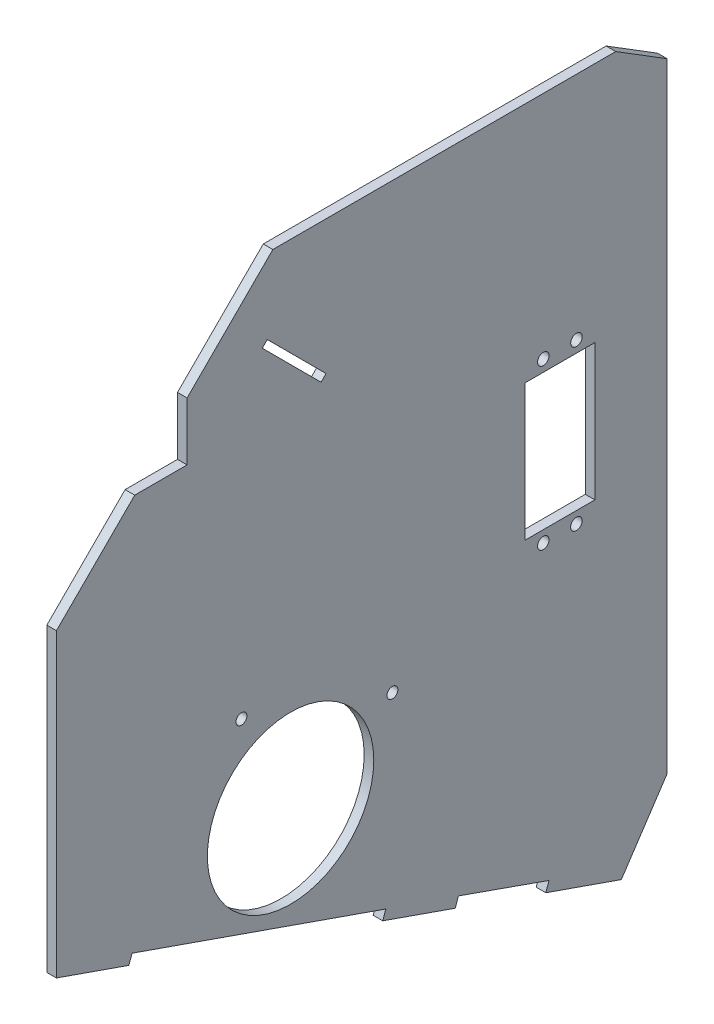
ISO-10303-21;
HEADER;
FILE_DESCRIPTION(('STEP AP214'),'2;1');
FILE_NAME('part.step','',(''),(''),'','','');
FILE_SCHEMA(('AUTOMOTIVE_DESIGN { 1 0 10303 214 1 1 1 1 }'));
ENDSEC;
DATA;
#1=APPLICATION_CONTEXT('core data for automotive mechanical design processes');
#2=APPLICATION_PROTOCOL_DEFINITION('international standard','automotive_design',2000,#1);
#3=PRODUCT_CONTEXT('',#1,'mechanical');
#4=PRODUCT('Part','Part','',(#3));
#5=PRODUCT_RELATED_PRODUCT_CATEGORY('part','',(#4));
#6=PRODUCT_DEFINITION_FORMATION('','',#4);
#7=PRODUCT_DEFINITION_CONTEXT('part definition',#1,'design');
#8=PRODUCT_DEFINITION('design','',#6,#7);
#9=PRODUCT_DEFINITION_SHAPE('','',#8);
#10=(LENGTH_UNIT() NAMED_UNIT(*) SI_UNIT(.MILLI.,.METRE.));
#11=(NAMED_UNIT(*) PLANE_ANGLE_UNIT() SI_UNIT($,.RADIAN.));
#12=(NAMED_UNIT(*) SI_UNIT($,.STERADIAN.) SOLID_ANGLE_UNIT());
#13=UNCERTAINTY_MEASURE_WITH_UNIT(LENGTH_MEASURE(1.E-05),#10,'distance_accuracy_value','');
#14=(GEOMETRIC_REPRESENTATION_CONTEXT(3) GLOBAL_UNCERTAINTY_ASSIGNED_CONTEXT((#13)) GLOBAL_UNIT_ASSIGNED_CONTEXT((#10,
#11,#12)) REPRESENTATION_CONTEXT('',''));
#15=CARTESIAN_POINT('',(0.,0.,0.));
#16=DIRECTION('',(0.,0.,1.));
#17=DIRECTION('',(1.,0.,0.));
#18=AXIS2_PLACEMENT_3D('',#15,#16,#17);
#19=CARTESIAN_POINT('',(3.,0.,0.));
#20=DIRECTION('',(1.,0.,0.));
#21=DIRECTION('',(0.,0.,-1.));
#22=AXIS2_PLACEMENT_3D('',#19,#20,#21);
#23=PLANE('',#22);
#24=CARTESIAN_POINT('',(3.,57.5278660397772,107.865704399093));
#25=DIRECTION('',(1.,0.,0.));
#26=DIRECTION('',(0.,0.,-1.));
#27=AXIS2_PLACEMENT_3D('',#24,#25,#26);
#28=CIRCLE('',#27,1.69999999999875);
#29=CARTESIAN_POINT('',(3.,57.5278660397772,106.165704399094));
#30=VERTEX_POINT('',#29);
#31=EDGE_CURVE('E283',#30,#30,#28,.T.);
#32=ORIENTED_EDGE('',*,*,#31,.F.);
#33=EDGE_LOOP('',(#32));
#34=FACE_BOUND('',#33,.T.);
#35=CARTESIAN_POINT('',(3.,124.247349718616,50.3478954464942));
#36=DIRECTION('',(1.,0.,0.));
#37=DIRECTION('',(0.,0.,-1.));
#38=AXIS2_PLACEMENT_3D('',#35,#36,#37);
#39=CIRCLE('',#38,1.8);
#40=CARTESIAN_POINT('',(3.,124.247349718616,48.5478954464942));
#41=VERTEX_POINT('',#40);
#42=EDGE_CURVE('E295',#41,#41,#39,.T.);
#43=ORIENTED_EDGE('',*,*,#42,.F.);
#44=EDGE_LOOP('',(#43));
#45=FACE_BOUND('',#44,.T.);
#46=CARTESIAN_POINT('',(3.,74.4515996529574,60.7183233739427));
#47=DIRECTION('',(1.,0.,0.));
#48=DIRECTION('',(0.,0.,-1.));
#49=AXIS2_PLACEMENT_3D('',#46,#47,#48);
#50=CIRCLE('',#49,1.80000000000001);
#51=CARTESIAN_POINT('',(3.,74.4515996529574,58.9183233739427));
#52=VERTEX_POINT('',#51);
#53=EDGE_CURVE('E307',#52,#52,#50,.T.);
#54=ORIENTED_EDGE('',*,*,#53,.F.);
#55=EDGE_LOOP('',(#54));
#56=FACE_BOUND('',#55,.T.);
#57=DIRECTION('',(0.,-0.944103150199417,0.329650180924473));
#58=VECTOR('',#57,1.);
#59=CARTESIAN_POINT('',(3.,-17.7737860904332,58.9376315426518));
#60=LINE('',#59,#58);
#61=CARTESIAN_POINT('',(3.,-17.7737860904332,58.9376315426518));
#62=VERTEX_POINT('',#61);
#63=CARTESIAN_POINT('',(3.,-20.6060955410317,59.9265820854253));
#64=VERTEX_POINT('',#63);
#65=EDGE_CURVE('E319',#62,#64,#60,.T.);
#66=ORIENTED_EDGE('',*,*,#65,.T.);
#67=DIRECTION('',(0.,-0.329650180924473,-0.944103150199417));
#68=VECTOR('',#67,1.);
#69=CARTESIAN_POINT('',(3.,-20.6060955410317,59.9265820854253));
#70=LINE('',#69,#68);
#71=CARTESIAN_POINT('',(3.,-28.8473378500354,36.3240383110907));
#72=VERTEX_POINT('',#71);
#73=EDGE_CURVE('E322',#64,#72,#70,.T.);
#74=ORIENTED_EDGE('',*,*,#73,.T.);
#75=DIRECTION('',(0.,0.832569631126317,-0.553920399810468));
#76=VECTOR('',#75,1.);
#77=CARTESIAN_POINT('',(3.,-28.8473378500354,36.3240383110907));
#78=LINE('',#77,#76);
#79=CARTESIAN_POINT('',(3.,-7.32270344611234,22.003393347539));
#80=VERTEX_POINT('',#79);
#81=EDGE_CURVE('E325',#72,#80,#78,.T.);
#82=ORIENTED_EDGE('',*,*,#81,.T.);
#83=DIRECTION('',(0.,1.,0.));
#84=VECTOR('',#83,1.);
#85=CARTESIAN_POINT('',(3.,-7.32270344611234,22.003393347539));
#86=LINE('',#85,#84);
#87=CARTESIAN_POINT('',(3.,186.164699152229,22.003393347539));
#88=VERTEX_POINT('',#87);
#89=EDGE_CURVE('E327',#80,#88,#86,.T.);
#90=ORIENTED_EDGE('',*,*,#89,.T.);
#91=DIRECTION('',(0.,0.527262029068287,0.849702743730296));
#92=VECTOR('',#91,1.);
#93=CARTESIAN_POINT('',(3.,196.142779130367,38.0834474139507));
#94=LINE('',#93,#92);
#95=CARTESIAN_POINT('',(3.,196.142779130367,38.0834474139507));
#96=VERTEX_POINT('',#95);
#97=EDGE_CURVE('E329',#88,#96,#94,.T.);
#98=ORIENTED_EDGE('',*,*,#97,.T.);
#99=DIRECTION('',(0.,0.,1.));
#100=VECTOR('',#99,1.);
#101=CARTESIAN_POINT('',(3.,196.142779130367,38.0834474139507));
#102=LINE('',#101,#100);
#103=CARTESIAN_POINT('',(3.,196.142779130367,145.230517160591));
#104=VERTEX_POINT('',#103);
#105=EDGE_CURVE('E331',#96,#104,#102,.T.);
#106=ORIENTED_EDGE('',*,*,#105,.T.);
#107=DIRECTION('',(0.,-0.706723293671588,0.70749006083618));
#108=VECTOR('',#107,1.);
#109=CARTESIAN_POINT('',(3.,169.366182910994,172.0361649408));
#110=LINE('',#109,#108);
#111=CARTESIAN_POINT('',(3.,169.366182910994,172.0361649408));
#112=VERTEX_POINT('',#111);
#113=EDGE_CURVE('E333',#104,#112,#110,.T.);
#114=ORIENTED_EDGE('',*,*,#113,.T.);
#115=DIRECTION('',(0.,-1.,0.));
#116=VECTOR('',#115,1.);
#117=CARTESIAN_POINT('',(3.,169.366182910994,172.0361649408));
#118=LINE('',#117,#116);
#119=CARTESIAN_POINT('',(3.,151.244509978863,172.0361649408));
#120=VERTEX_POINT('',#119);
#121=EDGE_CURVE('E335',#112,#120,#118,.T.);
#122=ORIENTED_EDGE('',*,*,#121,.T.);
#123=DIRECTION('',(0.,0.,1.));
#124=VECTOR('',#123,1.);
#125=CARTESIAN_POINT('',(3.,151.244509978863,172.0361649408));
#126=LINE('',#125,#124);
#127=CARTESIAN_POINT('',(3.,151.244509978863,188.398196233514));
#128=VERTEX_POINT('',#127);
#129=EDGE_CURVE('E337',#120,#128,#126,.T.);
#130=ORIENTED_EDGE('',*,*,#129,.T.);
#131=DIRECTION('',(0.,-0.706723293671587,0.707490060836181));
#132=VECTOR('',#131,1.);
#133=CARTESIAN_POINT('',(3.,151.244509978863,188.398196233514));
#134=LINE('',#133,#132);
#135=CARTESIAN_POINT('',(3.,126.797932250777,212.871297543398));
#136=VERTEX_POINT('',#135);
#137=EDGE_CURVE('E339',#128,#136,#134,.T.);
#138=ORIENTED_EDGE('',*,*,#137,.T.);
#139=DIRECTION('',(0.,-1.,0.));
#140=VECTOR('',#139,1.);
#141=CARTESIAN_POINT('',(3.,32.7972355584499,212.871297543398));
#142=LINE('',#141,#140);
#143=CARTESIAN_POINT('',(3.,32.7972355584499,212.871297543398));
#144=VERTEX_POINT('',#143);
#145=EDGE_CURVE('E341',#136,#144,#142,.T.);
#146=ORIENTED_EDGE('',*,*,#145,.T.);
#147=DIRECTION('',(0.,-0.329650180924472,-0.944103150199417));
#148=VECTOR('',#147,1.);
#149=CARTESIAN_POINT('',(3.,32.7972355584499,212.871297543398));
#150=LINE('',#149,#148);
#151=CARTESIAN_POINT('',(3.,24.8856312162626,190.212821938612));
#152=VERTEX_POINT('',#151);
#153=EDGE_CURVE('E343',#144,#152,#150,.T.);
#154=ORIENTED_EDGE('',*,*,#153,.T.);
#155=DIRECTION('',(0.,0.944103150199417,-0.329650180924471));
#156=VECTOR('',#155,1.);
#157=CARTESIAN_POINT('',(3.,24.8856312162626,190.212821938612));
#158=LINE('',#157,#156);
#159=CARTESIAN_POINT('',(3.,27.6833665917013,189.235943540847));
#160=VERTEX_POINT('',#159);
#161=EDGE_CURVE('E345',#152,#160,#158,.T.);
#162=ORIENTED_EDGE('',*,*,#161,.T.);
#163=DIRECTION('',(0.,-0.329650180924472,-0.944103150199417));
#164=VECTOR('',#163,1.);
#165=CARTESIAN_POINT('',(3.,27.6833665917013,189.235943540847));
#166=LINE('',#165,#164);
#167=CARTESIAN_POINT('',(3.,-0.0072486059534398,109.931278924098));
#168=VERTEX_POINT('',#167);
#169=EDGE_CURVE('E347',#160,#168,#166,.T.);
#170=ORIENTED_EDGE('',*,*,#169,.T.);
#171=DIRECTION('',(0.,-0.944103150199422,0.329650180924458));
#172=VECTOR('',#171,1.);
#173=CARTESIAN_POINT('',(3.,-0.0072486059534398,109.931278924098));
#174=LINE('',#173,#172);
#175=CARTESIAN_POINT('',(3.,-2.73116639764507,110.882382617233));
#176=VERTEX_POINT('',#175);
#177=EDGE_CURVE('E349',#168,#176,#174,.T.);
#178=ORIENTED_EDGE('',*,*,#177,.T.);
#179=DIRECTION('',(0.,-0.329650180924472,-0.944103150199417));
#180=VECTOR('',#179,1.);
#181=CARTESIAN_POINT('',(3.,-2.73116639764507,110.882382617233));
#182=LINE('',#181,#180);
#183=CARTESIAN_POINT('',(3.,-10.6430324792257,88.2231574027088));
#184=VERTEX_POINT('',#183);
#185=EDGE_CURVE('E351',#176,#184,#182,.T.);
#186=ORIENTED_EDGE('',*,*,#185,.T.);
#187=DIRECTION('',(0.,0.944103150199416,-0.329650180924475));
#188=VECTOR('',#187,1.);
#189=CARTESIAN_POINT('',(3.,-10.6430324792257,88.2231574027088));
#190=LINE('',#189,#188);
#191=CARTESIAN_POINT('',(3.,-7.81072302862727,87.2342068599353));
#192=VERTEX_POINT('',#191);
#193=EDGE_CURVE('E353',#184,#192,#190,.T.);
#194=ORIENTED_EDGE('',*,*,#193,.T.);
#195=DIRECTION('',(0.,-0.332109703721291,-0.943240767086621));
#196=VECTOR('',#195,1.);
#197=CARTESIAN_POINT('',(3.,-7.81072302862727,87.2342068599353));
#198=LINE('',#197,#196);
#199=EDGE_CURVE('E355',#192,#62,#198,.T.);
#200=ORIENTED_EDGE('',*,*,#199,.T.);
#201=EDGE_LOOP('',(#66,#74,#82,#90,#98,#106,#114,#122,#130,#138,#146,#154,#162,#170,#178,#186,
#194,#200));
#202=FACE_BOUND('',#201,.T.);
#203=CARTESIAN_POINT('',(3.,74.4473539087353,50.3683242447806));
#204=DIRECTION('',(1.,0.,0.));
#205=DIRECTION('',(0.,0.,-1.));
#206=AXIS2_PLACEMENT_3D('',#203,#204,#205);
#207=CIRCLE('',#206,1.8);
#208=CARTESIAN_POINT('',(3.,74.4473539087353,48.5683242447806));
#209=VERTEX_POINT('',#208);
#210=EDGE_CURVE('E313',#209,#209,#207,.T.);
#211=ORIENTED_EDGE('',*,*,#210,.F.);
#212=EDGE_LOOP('',(#211));
#213=FACE_BOUND('',#212,.T.);
#214=CARTESIAN_POINT('',(3.,124.251595462838,60.6978945756572));
#215=DIRECTION('',(1.,0.,0.));
#216=DIRECTION('',(0.,0.,-1.));
#217=AXIS2_PLACEMENT_3D('',#214,#215,#216);
#218=CIRCLE('',#217,1.80000000000087);
#219=CARTESIAN_POINT('',(3.,124.251595462838,58.8978945756563));
#220=VERTEX_POINT('',#219);
#221=EDGE_CURVE('E301',#220,#220,#218,.T.);
#222=ORIENTED_EDGE('',*,*,#221,.F.);
#223=EDGE_LOOP('',(#222));
#224=FACE_BOUND('',#223,.T.);
#225=CARTESIAN_POINT('',(3.,73.9995984679067,155.03999816416));
#226=DIRECTION('',(1.,0.,0.));
#227=DIRECTION('',(0.,0.,-1.));
#228=AXIS2_PLACEMENT_3D('',#225,#226,#227);
#229=CIRCLE('',#228,1.69999999999731);
#230=CARTESIAN_POINT('',(3.,73.9995984679067,153.339998164163));
#231=VERTEX_POINT('',#230);
#232=EDGE_CURVE('E289',#231,#231,#229,.T.);
#233=ORIENTED_EDGE('',*,*,#232,.F.);
#234=EDGE_LOOP('',(#233));
#235=FACE_BOUND('',#234,.T.);
#236=CARTESIAN_POINT('',(3.,42.1611534988563,139.694105804738));
#237=DIRECTION('',(1.,0.,0.));
#238=DIRECTION('',(0.,0.,-1.));
#239=AXIS2_PLACEMENT_3D('',#236,#237,#238);
#240=CIRCLE('',#239,25.9999999999998);
#241=CARTESIAN_POINT('',(3.,42.1611534988563,113.694105804739));
#242=VERTEX_POINT('',#241);
#243=EDGE_CURVE('E277',#242,#242,#240,.T.);
#244=ORIENTED_EDGE('',*,*,#243,.F.);
#245=EDGE_LOOP('',(#244));
#246=FACE_BOUND('',#245,.T.);
#247=DIRECTION('',(0.,-0.70672329367158,0.707490060836188));
#248=VECTOR('',#247,1.);
#249=CARTESIAN_POINT('',(3.,171.081773838305,148.53509158779));
#250=LINE('',#249,#248);
#251=CARTESIAN_POINT('',(3.,172.643579933777,146.971590993718));
#252=VERTEX_POINT('',#251);
#253=CARTESIAN_POINT('',(3.,171.081773838305,148.53509158779));
#254=VERTEX_POINT('',#253);
#255=EDGE_CURVE('E248',#252,#254,#250,.T.);
#256=ORIENTED_EDGE('',*,*,#255,.F.);
#257=DIRECTION('',(0.,0.707490060836181,0.706723293671587));
#258=VECTOR('',#257,1.);
#259=CARTESIAN_POINT('',(3.,172.643579933777,146.971590993718));
#260=LINE('',#259,#258);
#261=CARTESIAN_POINT('',(3.,154.248838352036,128.596785358257));
#262=VERTEX_POINT('',#261);
#263=EDGE_CURVE('E246',#262,#252,#260,.T.);
#264=ORIENTED_EDGE('',*,*,#263,.F.);
#265=DIRECTION('',(0.,0.706723293671587,-0.707490060836182));
#266=VECTOR('',#265,1.);
#267=CARTESIAN_POINT('',(3.,154.248838352036,128.596785358257));
#268=LINE('',#267,#266);
#269=CARTESIAN_POINT('',(3.,152.687032256564,130.160285952329));
#270=VERTEX_POINT('',#269);
#271=EDGE_CURVE('E254',#270,#262,#268,.T.);
#272=ORIENTED_EDGE('',*,*,#271,.F.);
#273=DIRECTION('',(0.,-0.707490060836181,-0.706723293671588));
#274=VECTOR('',#273,1.);
#275=CARTESIAN_POINT('',(3.,171.081773838305,148.53509158779));
#276=LINE('',#275,#274);
#277=EDGE_CURVE('E251',#254,#270,#276,.T.);
#278=ORIENTED_EDGE('',*,*,#277,.F.);
#279=EDGE_LOOP('',(#256,#264,#272,#278));
#280=FACE_BOUND('',#279,.T.);
#281=DIRECTION('',(0.,0.,1.));
#282=VECTOR('',#281,1.);
#283=CARTESIAN_POINT('',(3.,120.638865578129,66.4722262665439));
#284=LINE('',#283,#282);
#285=CARTESIAN_POINT('',(3.,120.638865578129,44.593992553893));
#286=VERTEX_POINT('',#285);
#287=CARTESIAN_POINT('',(3.,120.638865578129,66.4722262665439));
#288=VERTEX_POINT('',#287);
#289=EDGE_CURVE('E218',#286,#288,#284,.T.);
#290=ORIENTED_EDGE('',*,*,#289,.F.);
#291=DIRECTION('',(0.,1.,0.));
#292=VECTOR('',#291,1.);
#293=CARTESIAN_POINT('',(3.,78.0600837934438,44.593992553893));
#294=LINE('',#293,#292);
#295=CARTESIAN_POINT('',(3.,78.0600837934438,44.593992553893));
#296=VERTEX_POINT('',#295);
#297=EDGE_CURVE('E210',#296,#286,#294,.T.);
#298=ORIENTED_EDGE('',*,*,#297,.F.);
#299=DIRECTION('',(0.,0.,-1.));
#300=VECTOR('',#299,1.);
#301=CARTESIAN_POINT('',(3.,78.0600837934438,66.4722262665439));
#302=LINE('',#301,#300);
#303=CARTESIAN_POINT('',(3.,78.0600837934438,66.4722262665439));
#304=VERTEX_POINT('',#303);
#305=EDGE_CURVE('E232',#304,#296,#302,.T.);
#306=ORIENTED_EDGE('',*,*,#305,.F.);
#307=DIRECTION('',(0.,-1.,0.));
#308=VECTOR('',#307,1.);
#309=CARTESIAN_POINT('',(3.,78.0600837934438,66.4722262665439));
#310=LINE('',#309,#308);
#311=EDGE_CURVE('E230',#288,#304,#310,.T.);
#312=ORIENTED_EDGE('',*,*,#311,.F.);
#313=EDGE_LOOP('',(#290,#298,#306,#312));
#314=FACE_BOUND('',#313,.T.);
#315=ADVANCED_FACE('F37',(#34,#45,#56,#202,#213,#224,#235,#246,#280,#314),#23,.T.);
#316=CARTESIAN_POINT('',(0.,0.,0.));
#317=DIRECTION('',(1.,0.,0.));
#318=DIRECTION('',(0.,0.,-1.));
#319=AXIS2_PLACEMENT_3D('',#316,#317,#318);
#320=PLANE('',#319);
#321=DIRECTION('',(0.,0.707490060836181,0.706723293671587));
#322=VECTOR('',#321,1.);
#323=CARTESIAN_POINT('',(0.,172.643579933777,146.971590993718));
#324=LINE('',#323,#322);
#325=CARTESIAN_POINT('',(0.,154.248838352036,128.596785358257));
#326=VERTEX_POINT('',#325);
#327=CARTESIAN_POINT('',(0.,172.643579933777,146.971590993718));
#328=VERTEX_POINT('',#327);
#329=EDGE_CURVE('E226',#326,#328,#324,.T.);
#330=ORIENTED_EDGE('',*,*,#329,.T.);
#331=DIRECTION('',(0.,-0.70672329367158,0.707490060836188));
#332=VECTOR('',#331,1.);
#333=CARTESIAN_POINT('',(0.,171.081773838305,148.53509158779));
#334=LINE('',#333,#332);
#335=CARTESIAN_POINT('',(0.,171.081773838305,148.53509158779));
#336=VERTEX_POINT('',#335);
#337=EDGE_CURVE('E259',#328,#336,#334,.T.);
#338=ORIENTED_EDGE('',*,*,#337,.T.);
#339=DIRECTION('',(0.,-0.707490060836181,-0.706723293671588));
#340=VECTOR('',#339,1.);
#341=CARTESIAN_POINT('',(0.,171.081773838305,148.53509158779));
#342=LINE('',#341,#340);
#343=CARTESIAN_POINT('',(0.,152.687032256564,130.160285952329));
#344=VERTEX_POINT('',#343);
#345=EDGE_CURVE('E262',#336,#344,#342,.T.);
#346=ORIENTED_EDGE('',*,*,#345,.T.);
#347=DIRECTION('',(0.,0.706723293671587,-0.707490060836182));
#348=VECTOR('',#347,1.);
#349=CARTESIAN_POINT('',(0.,154.248838352036,128.596785358257));
#350=LINE('',#349,#348);
#351=EDGE_CURVE('E249',#344,#326,#350,.T.);
#352=ORIENTED_EDGE('',*,*,#351,.T.);
#353=EDGE_LOOP('',(#330,#338,#346,#352));
#354=FACE_BOUND('',#353,.T.);
#355=DIRECTION('',(0.,-0.944103150199417,0.329650180924473));
#356=VECTOR('',#355,1.);
#357=CARTESIAN_POINT('',(0.,-17.7737860904332,58.9376315426518));
#358=LINE('',#357,#356);
#359=CARTESIAN_POINT('',(0.,-17.7737860904332,58.9376315426518));
#360=VERTEX_POINT('',#359);
#361=CARTESIAN_POINT('',(0.,-20.6060955410317,59.9265820854253));
#362=VERTEX_POINT('',#361);
#363=EDGE_CURVE('E316',#360,#362,#358,.T.);
#364=ORIENTED_EDGE('',*,*,#363,.F.);
#365=DIRECTION('',(0.,-0.332109703721291,-0.943240767086621));
#366=VECTOR('',#365,1.);
#367=CARTESIAN_POINT('',(0.,-7.81072302862727,87.2342068599353));
#368=LINE('',#367,#366);
#369=CARTESIAN_POINT('',(0.,-7.81072302862727,87.2342068599353));
#370=VERTEX_POINT('',#369);
#371=EDGE_CURVE('E323',#370,#360,#368,.T.);
#372=ORIENTED_EDGE('',*,*,#371,.F.);
#373=DIRECTION('',(0.,0.944103150199416,-0.329650180924475));
#374=VECTOR('',#373,1.);
#375=CARTESIAN_POINT('',(0.,-10.6430324792257,88.2231574027088));
#376=LINE('',#375,#374);
#377=CARTESIAN_POINT('',(0.,-10.6430324792257,88.2231574027088));
#378=VERTEX_POINT('',#377);
#379=EDGE_CURVE('E390',#378,#370,#376,.T.);
#380=ORIENTED_EDGE('',*,*,#379,.F.);
#381=DIRECTION('',(0.,-0.329650180924472,-0.944103150199417));
#382=VECTOR('',#381,1.);
#383=CARTESIAN_POINT('',(0.,-2.73116639764507,110.882382617233));
#384=LINE('',#383,#382);
#385=CARTESIAN_POINT('',(0.,-2.73116639764507,110.882382617233));
#386=VERTEX_POINT('',#385);
#387=EDGE_CURVE('E388',#386,#378,#384,.T.);
#388=ORIENTED_EDGE('',*,*,#387,.F.);
#389=DIRECTION('',(0.,-0.944103150199422,0.329650180924458));
#390=VECTOR('',#389,1.);
#391=CARTESIAN_POINT('',(0.,-0.0072486059534398,109.931278924098));
#392=LINE('',#391,#390);
#393=CARTESIAN_POINT('',(0.,-0.0072486059534398,109.931278924098));
#394=VERTEX_POINT('',#393);
#395=EDGE_CURVE('E386',#394,#386,#392,.T.);
#396=ORIENTED_EDGE('',*,*,#395,.F.);
#397=DIRECTION('',(0.,-0.329650180924472,-0.944103150199417));
#398=VECTOR('',#397,1.);
#399=CARTESIAN_POINT('',(0.,27.6833665917013,189.235943540847));
#400=LINE('',#399,#398);
#401=CARTESIAN_POINT('',(0.,27.6833665917013,189.235943540847));
#402=VERTEX_POINT('',#401);
#403=EDGE_CURVE('E384',#402,#394,#400,.T.);
#404=ORIENTED_EDGE('',*,*,#403,.F.);
#405=DIRECTION('',(0.,0.944103150199417,-0.329650180924471));
#406=VECTOR('',#405,1.);
#407=CARTESIAN_POINT('',(0.,24.8856312162626,190.212821938612));
#408=LINE('',#407,#406);
#409=CARTESIAN_POINT('',(0.,24.8856312162626,190.212821938612));
#410=VERTEX_POINT('',#409);
#411=EDGE_CURVE('E382',#410,#402,#408,.T.);
#412=ORIENTED_EDGE('',*,*,#411,.F.);
#413=DIRECTION('',(0.,-0.329650180924472,-0.944103150199417));
#414=VECTOR('',#413,1.);
#415=CARTESIAN_POINT('',(0.,32.7972355584499,212.871297543398));
#416=LINE('',#415,#414);
#417=CARTESIAN_POINT('',(0.,32.7972355584499,212.871297543398));
#418=VERTEX_POINT('',#417);
#419=EDGE_CURVE('E380',#418,#410,#416,.T.);
#420=ORIENTED_EDGE('',*,*,#419,.F.);
#421=DIRECTION('',(0.,-1.,0.));
#422=VECTOR('',#421,1.);
#423=CARTESIAN_POINT('',(0.,32.7972355584499,212.871297543398));
#424=LINE('',#423,#422);
#425=CARTESIAN_POINT('',(0.,126.797932250777,212.871297543398));
#426=VERTEX_POINT('',#425);
#427=EDGE_CURVE('E378',#426,#418,#424,.T.);
#428=ORIENTED_EDGE('',*,*,#427,.F.);
#429=DIRECTION('',(0.,-0.706723293671587,0.707490060836181));
#430=VECTOR('',#429,1.);
#431=CARTESIAN_POINT('',(0.,151.244509978863,188.398196233514));
#432=LINE('',#431,#430);
#433=CARTESIAN_POINT('',(0.,151.244509978863,188.398196233514));
#434=VERTEX_POINT('',#433);
#435=EDGE_CURVE('E376',#434,#426,#432,.T.);
#436=ORIENTED_EDGE('',*,*,#435,.F.);
#437=DIRECTION('',(0.,0.,1.));
#438=VECTOR('',#437,1.);
#439=CARTESIAN_POINT('',(0.,151.244509978863,172.0361649408));
#440=LINE('',#439,#438);
#441=CARTESIAN_POINT('',(0.,151.244509978863,172.0361649408));
#442=VERTEX_POINT('',#441);
#443=EDGE_CURVE('E374',#442,#434,#440,.T.);
#444=ORIENTED_EDGE('',*,*,#443,.F.);
#445=DIRECTION('',(0.,-1.,0.));
#446=VECTOR('',#445,1.);
#447=CARTESIAN_POINT('',(0.,169.366182910994,172.0361649408));
#448=LINE('',#447,#446);
#449=CARTESIAN_POINT('',(0.,169.366182910994,172.0361649408));
#450=VERTEX_POINT('',#449);
#451=EDGE_CURVE('E372',#450,#442,#448,.T.);
#452=ORIENTED_EDGE('',*,*,#451,.F.);
#453=DIRECTION('',(0.,-0.706723293671588,0.70749006083618));
#454=VECTOR('',#453,1.);
#455=CARTESIAN_POINT('',(0.,169.366182910994,172.0361649408));
#456=LINE('',#455,#454);
#457=CARTESIAN_POINT('',(0.,196.142779130367,145.230517160591));
#458=VERTEX_POINT('',#457);
#459=EDGE_CURVE('E370',#458,#450,#456,.T.);
#460=ORIENTED_EDGE('',*,*,#459,.F.);
#461=DIRECTION('',(0.,0.,1.));
#462=VECTOR('',#461,1.);
#463=CARTESIAN_POINT('',(0.,196.142779130367,38.0834474139507));
#464=LINE('',#463,#462);
#465=CARTESIAN_POINT('',(0.,196.142779130367,38.0834474139507));
#466=VERTEX_POINT('',#465);
#467=EDGE_CURVE('E368',#466,#458,#464,.T.);
#468=ORIENTED_EDGE('',*,*,#467,.F.);
#469=DIRECTION('',(0.,0.527262029068287,0.849702743730296));
#470=VECTOR('',#469,1.);
#471=CARTESIAN_POINT('',(0.,196.142779130367,38.0834474139507));
#472=LINE('',#471,#470);
#473=CARTESIAN_POINT('',(0.,186.164699152229,22.003393347539));
#474=VERTEX_POINT('',#473);
#475=EDGE_CURVE('E366',#474,#466,#472,.T.);
#476=ORIENTED_EDGE('',*,*,#475,.F.);
#477=DIRECTION('',(0.,1.,0.));
#478=VECTOR('',#477,1.);
#479=CARTESIAN_POINT('',(0.,-7.32270344611234,22.003393347539));
#480=LINE('',#479,#478);
#481=CARTESIAN_POINT('',(0.,-7.32270344611234,22.003393347539));
#482=VERTEX_POINT('',#481);
#483=EDGE_CURVE('E364',#482,#474,#480,.T.);
#484=ORIENTED_EDGE('',*,*,#483,.F.);
#485=DIRECTION('',(0.,0.832569631126317,-0.553920399810468));
#486=VECTOR('',#485,1.);
#487=CARTESIAN_POINT('',(0.,-28.8473378500354,36.3240383110907));
#488=LINE('',#487,#486);
#489=CARTESIAN_POINT('',(0.,-28.8473378500354,36.3240383110907));
#490=VERTEX_POINT('',#489);
#491=EDGE_CURVE('E362',#490,#482,#488,.T.);
#492=ORIENTED_EDGE('',*,*,#491,.F.);
#493=DIRECTION('',(0.,-0.329650180924473,-0.944103150199417));
#494=VECTOR('',#493,1.);
#495=CARTESIAN_POINT('',(0.,-20.6060955410317,59.9265820854253));
#496=LINE('',#495,#494);
#497=EDGE_CURVE('E360',#362,#490,#496,.T.);
#498=ORIENTED_EDGE('',*,*,#497,.F.);
#499=EDGE_LOOP('',(#364,#372,#380,#388,#396,#404,#412,#420,#428,#436,#444,#452,#460,#468,#476,
#484,#492,#498));
#500=FACE_BOUND('',#499,.T.);
#501=CARTESIAN_POINT('',(0.,74.4473539087353,50.3683242447806));
#502=DIRECTION('',(1.,0.,0.));
#503=DIRECTION('',(0.,0.,-1.));
#504=AXIS2_PLACEMENT_3D('',#501,#502,#503);
#505=CIRCLE('',#504,1.8);
#506=CARTESIAN_POINT('',(0.,74.4473539087353,48.5683242447806));
#507=VERTEX_POINT('',#506);
#508=EDGE_CURVE('E310',#507,#507,#505,.T.);
#509=ORIENTED_EDGE('',*,*,#508,.T.);
#510=EDGE_LOOP('',(#509));
#511=FACE_BOUND('',#510,.T.);
#512=CARTESIAN_POINT('',(0.,74.4515996529574,60.7183233739427));
#513=DIRECTION('',(1.,0.,0.));
#514=DIRECTION('',(0.,0.,-1.));
#515=AXIS2_PLACEMENT_3D('',#512,#513,#514);
#516=CIRCLE('',#515,1.80000000000001);
#517=CARTESIAN_POINT('',(0.,74.4515996529574,58.9183233739427));
#518=VERTEX_POINT('',#517);
#519=EDGE_CURVE('E304',#518,#518,#516,.T.);
#520=ORIENTED_EDGE('',*,*,#519,.T.);
#521=EDGE_LOOP('',(#520));
#522=FACE_BOUND('',#521,.T.);
#523=CARTESIAN_POINT('',(0.,124.251595462838,60.6978945756572));
#524=DIRECTION('',(1.,0.,0.));
#525=DIRECTION('',(0.,0.,-1.));
#526=AXIS2_PLACEMENT_3D('',#523,#524,#525);
#527=CIRCLE('',#526,1.80000000000087);
#528=CARTESIAN_POINT('',(0.,124.251595462838,58.8978945756563));
#529=VERTEX_POINT('',#528);
#530=EDGE_CURVE('E298',#529,#529,#527,.T.);
#531=ORIENTED_EDGE('',*,*,#530,.T.);
#532=EDGE_LOOP('',(#531));
#533=FACE_BOUND('',#532,.T.);
#534=CARTESIAN_POINT('',(0.,124.247349718616,50.3478954464942));
#535=DIRECTION('',(1.,0.,0.));
#536=DIRECTION('',(0.,0.,-1.));
#537=AXIS2_PLACEMENT_3D('',#534,#535,#536);
#538=CIRCLE('',#537,1.8);
#539=CARTESIAN_POINT('',(0.,124.247349718616,48.5478954464942));
#540=VERTEX_POINT('',#539);
#541=EDGE_CURVE('E292',#540,#540,#538,.T.);
#542=ORIENTED_EDGE('',*,*,#541,.T.);
#543=EDGE_LOOP('',(#542));
#544=FACE_BOUND('',#543,.T.);
#545=CARTESIAN_POINT('',(0.,73.9995984679067,155.03999816416));
#546=DIRECTION('',(1.,0.,0.));
#547=DIRECTION('',(0.,0.,-1.));
#548=AXIS2_PLACEMENT_3D('',#545,#546,#547);
#549=CIRCLE('',#548,1.69999999999731);
#550=CARTESIAN_POINT('',(0.,73.9995984679067,153.339998164163));
#551=VERTEX_POINT('',#550);
#552=EDGE_CURVE('E286',#551,#551,#549,.T.);
#553=ORIENTED_EDGE('',*,*,#552,.T.);
#554=EDGE_LOOP('',(#553));
#555=FACE_BOUND('',#554,.T.);
#556=CARTESIAN_POINT('',(0.,57.5278660397772,107.865704399093));
#557=DIRECTION('',(1.,0.,0.));
#558=DIRECTION('',(0.,0.,-1.));
#559=AXIS2_PLACEMENT_3D('',#556,#557,#558);
#560=CIRCLE('',#559,1.69999999999875);
#561=CARTESIAN_POINT('',(0.,57.5278660397772,106.165704399094));
#562=VERTEX_POINT('',#561);
#563=EDGE_CURVE('E280',#562,#562,#560,.T.);
#564=ORIENTED_EDGE('',*,*,#563,.T.);
#565=EDGE_LOOP('',(#564));
#566=FACE_BOUND('',#565,.T.);
#567=CARTESIAN_POINT('',(0.,42.1611534988563,139.694105804738));
#568=DIRECTION('',(1.,0.,0.));
#569=DIRECTION('',(0.,0.,-1.));
#570=AXIS2_PLACEMENT_3D('',#567,#568,#569);
#571=CIRCLE('',#570,25.9999999999998);
#572=CARTESIAN_POINT('',(0.,42.1611534988563,113.694105804739));
#573=VERTEX_POINT('',#572);
#574=EDGE_CURVE('E276',#573,#573,#571,.T.);
#575=ORIENTED_EDGE('',*,*,#574,.T.);
#576=EDGE_LOOP('',(#575));
#577=FACE_BOUND('',#576,.T.);
#578=DIRECTION('',(0.,1.,0.));
#579=VECTOR('',#578,1.);
#580=CARTESIAN_POINT('',(0.,78.0600837934438,44.593992553893));
#581=LINE('',#580,#579);
#582=CARTESIAN_POINT('',(0.,78.0600837934438,44.593992553893));
#583=VERTEX_POINT('',#582);
#584=CARTESIAN_POINT('',(0.,120.638865578129,44.593992553893));
#585=VERTEX_POINT('',#584);
#586=EDGE_CURVE('E60',#583,#585,#581,.T.);
#587=ORIENTED_EDGE('',*,*,#586,.T.);
#588=DIRECTION('',(0.,0.,1.));
#589=VECTOR('',#588,1.);
#590=CARTESIAN_POINT('',(0.,120.638865578129,66.4722262665439));
#591=LINE('',#590,#589);
#592=CARTESIAN_POINT('',(0.,120.638865578129,66.4722262665439));
#593=VERTEX_POINT('',#592);
#594=EDGE_CURVE('E225',#585,#593,#591,.T.);
#595=ORIENTED_EDGE('',*,*,#594,.T.);
#596=DIRECTION('',(0.,-1.,0.));
#597=VECTOR('',#596,1.);
#598=CARTESIAN_POINT('',(0.,78.0600837934438,66.4722262665439));
#599=LINE('',#598,#597);
#600=CARTESIAN_POINT('',(0.,78.0600837934438,66.4722262665439));
#601=VERTEX_POINT('',#600);
#602=EDGE_CURVE('E238',#593,#601,#599,.T.);
#603=ORIENTED_EDGE('',*,*,#602,.T.);
#604=DIRECTION('',(0.,0.,-1.));
#605=VECTOR('',#604,1.);
#606=CARTESIAN_POINT('',(0.,78.0600837934438,66.4722262665439));
#607=LINE('',#606,#605);
#608=EDGE_CURVE('E219',#601,#583,#607,.T.);
#609=ORIENTED_EDGE('',*,*,#608,.T.);
#610=EDGE_LOOP('',(#587,#595,#603,#609));
#611=FACE_BOUND('',#610,.T.);
#612=ADVANCED_FACE('F450',(#354,#500,#511,#522,#533,#544,#555,#566,#577,#611),#320,.F.);
#613=CARTESIAN_POINT('',(3.,-17.7737860904332,58.9376315426518));
#614=DIRECTION('',(0.,-0.329650180924473,-0.944103150199417));
#615=DIRECTION('',(0.,0.944103150199417,-0.329650180924473));
#616=AXIS2_PLACEMENT_3D('',#613,#614,#615);
#617=PLANE('',#616);
#618=ORIENTED_EDGE('',*,*,#363,.T.);
#619=DIRECTION('',(-1.,0.,0.));
#620=VECTOR('',#619,1.);
#621=CARTESIAN_POINT('',(3.,-20.6060955410317,59.9265820854253));
#622=LINE('',#621,#620);
#623=EDGE_CURVE('E11',#64,#362,#622,.T.);
#624=ORIENTED_EDGE('',*,*,#623,.F.);
#625=ORIENTED_EDGE('',*,*,#65,.F.);
#626=DIRECTION('',(-1.,0.,0.));
#627=VECTOR('',#626,1.);
#628=CARTESIAN_POINT('',(3.,-17.7737860904332,58.9376315426518));
#629=LINE('',#628,#627);
#630=EDGE_CURVE('E357',#62,#360,#629,.T.);
#631=ORIENTED_EDGE('',*,*,#630,.T.);
#632=EDGE_LOOP('',(#618,#624,#625,#631));
#633=FACE_BOUND('',#632,.T.);
#634=ADVANCED_FACE('F39',(#633),#617,.F.);
#635=CARTESIAN_POINT('',(3.,-20.6060955410317,59.9265820854253));
#636=DIRECTION('',(0.,0.944103150199416,-0.329650180924473));
#637=DIRECTION('',(0.,0.329650180924473,0.944103150199417));
#638=AXIS2_PLACEMENT_3D('',#635,#636,#637);
#639=PLANE('',#638);
#640=ORIENTED_EDGE('',*,*,#497,.T.);
#641=DIRECTION('',(-1.,0.,0.));
#642=VECTOR('',#641,1.);
#643=CARTESIAN_POINT('',(3.,-28.8473378500354,36.3240383110907));
#644=LINE('',#643,#642);
#645=EDGE_CURVE('E45',#72,#490,#644,.T.);
#646=ORIENTED_EDGE('',*,*,#645,.F.);
#647=ORIENTED_EDGE('',*,*,#73,.F.);
#648=ORIENTED_EDGE('',*,*,#623,.T.);
#649=EDGE_LOOP('',(#640,#646,#647,#648));
#650=FACE_BOUND('',#649,.T.);
#651=ADVANCED_FACE('F468',(#650),#639,.F.);
#652=CARTESIAN_POINT('',(3.,-28.8473378500354,36.3240383110907));
#653=DIRECTION('',(0.,0.553920399810468,0.832569631126317));
#654=DIRECTION('',(0.,-0.832569631126317,0.553920399810468));
#655=AXIS2_PLACEMENT_3D('',#652,#653,#654);
#656=PLANE('',#655);
#657=ORIENTED_EDGE('',*,*,#491,.T.);
#658=DIRECTION('',(-1.,0.,0.));
#659=VECTOR('',#658,1.);
#660=CARTESIAN_POINT('',(3.,-7.32270344611234,22.003393347539));
#661=LINE('',#660,#659);
#662=EDGE_CURVE('E437',#80,#482,#661,.T.);
#663=ORIENTED_EDGE('',*,*,#662,.F.);
#664=ORIENTED_EDGE('',*,*,#81,.F.);
#665=ORIENTED_EDGE('',*,*,#645,.T.);
#666=EDGE_LOOP('',(#657,#663,#664,#665));
#667=FACE_BOUND('',#666,.T.);
#668=ADVANCED_FACE('F444',(#667),#656,.F.);
#669=CARTESIAN_POINT('',(3.,-7.32270344611234,22.003393347539));
#670=DIRECTION('',(0.,0.,1.));
#671=DIRECTION('',(1.,0.,0.));
#672=AXIS2_PLACEMENT_3D('',#669,#670,#671);
#673=PLANE('',#672);
#674=ORIENTED_EDGE('',*,*,#483,.T.);
#675=DIRECTION('',(-1.,0.,0.));
#676=VECTOR('',#675,1.);
#677=CARTESIAN_POINT('',(3.,186.164699152229,22.003393347539));
#678=LINE('',#677,#676);
#679=EDGE_CURVE('E434',#88,#474,#678,.T.);
#680=ORIENTED_EDGE('',*,*,#679,.F.);
#681=ORIENTED_EDGE('',*,*,#89,.F.);
#682=ORIENTED_EDGE('',*,*,#662,.T.);
#683=EDGE_LOOP('',(#674,#680,#681,#682));
#684=FACE_BOUND('',#683,.T.);
#685=ADVANCED_FACE('F456',(#684),#673,.F.);
#686=CARTESIAN_POINT('',(3.,196.142779130367,38.0834474139507));
#687=DIRECTION('',(0.,-0.849702743730296,0.527262029068287));
#688=DIRECTION('',(0.,-0.527262029068287,-0.849702743730296));
#689=AXIS2_PLACEMENT_3D('',#686,#687,#688);
#690=PLANE('',#689);
#691=ORIENTED_EDGE('',*,*,#475,.T.);
#692=DIRECTION('',(-1.,0.,0.));
#693=VECTOR('',#692,1.);
#694=CARTESIAN_POINT('',(3.,196.142779130367,38.0834474139507));
#695=LINE('',#694,#693);
#696=EDGE_CURVE('E431',#96,#466,#695,.T.);
#697=ORIENTED_EDGE('',*,*,#696,.F.);
#698=ORIENTED_EDGE('',*,*,#97,.F.);
#699=ORIENTED_EDGE('',*,*,#679,.T.);
#700=EDGE_LOOP('',(#691,#697,#698,#699));
#701=FACE_BOUND('',#700,.T.);
#702=ADVANCED_FACE('F460',(#701),#690,.F.);
#703=CARTESIAN_POINT('',(3.,196.142779130367,38.0834474139507));
#704=DIRECTION('',(0.,-1.,0.));
#705=DIRECTION('',(0.,0.,-1.));
#706=AXIS2_PLACEMENT_3D('',#703,#704,#705);
#707=PLANE('',#706);
#708=ORIENTED_EDGE('',*,*,#467,.T.);
#709=DIRECTION('',(-1.,0.,0.));
#710=VECTOR('',#709,1.);
#711=CARTESIAN_POINT('',(3.,196.142779130367,145.230517160591));
#712=LINE('',#711,#710);
#713=EDGE_CURVE('E428',#104,#458,#712,.T.);
#714=ORIENTED_EDGE('',*,*,#713,.F.);
#715=ORIENTED_EDGE('',*,*,#105,.F.);
#716=ORIENTED_EDGE('',*,*,#696,.T.);
#717=EDGE_LOOP('',(#708,#714,#715,#716));
#718=FACE_BOUND('',#717,.T.);
#719=ADVANCED_FACE('F531',(#718),#707,.F.);
#720=CARTESIAN_POINT('',(3.,169.366182910994,172.0361649408));
#721=DIRECTION('',(0.,-0.707490060836181,-0.706723293671588));
#722=DIRECTION('',(0.,0.706723293671588,-0.707490060836181));
#723=AXIS2_PLACEMENT_3D('',#720,#721,#722);
#724=PLANE('',#723);
#725=ORIENTED_EDGE('',*,*,#459,.T.);
#726=DIRECTION('',(-1.,0.,0.));
#727=VECTOR('',#726,1.);
#728=CARTESIAN_POINT('',(3.,169.366182910994,172.0361649408));
#729=LINE('',#728,#727);
#730=EDGE_CURVE('E425',#112,#450,#729,.T.);
#731=ORIENTED_EDGE('',*,*,#730,.F.);
#732=ORIENTED_EDGE('',*,*,#113,.F.);
#733=ORIENTED_EDGE('',*,*,#713,.T.);
#734=EDGE_LOOP('',(#725,#731,#732,#733));
#735=FACE_BOUND('',#734,.T.);
#736=ADVANCED_FACE('F529',(#735),#724,.F.);
#737=CARTESIAN_POINT('',(3.,169.366182910994,172.0361649408));
#738=DIRECTION('',(0.,0.,-1.));
#739=DIRECTION('',(-1.,0.,0.));
#740=AXIS2_PLACEMENT_3D('',#737,#738,#739);
#741=PLANE('',#740);
#742=ORIENTED_EDGE('',*,*,#451,.T.);
#743=DIRECTION('',(-1.,0.,0.));
#744=VECTOR('',#743,1.);
#745=CARTESIAN_POINT('',(3.,151.244509978863,172.0361649408));
#746=LINE('',#745,#744);
#747=EDGE_CURVE('E422',#120,#442,#746,.T.);
#748=ORIENTED_EDGE('',*,*,#747,.F.);
#749=ORIENTED_EDGE('',*,*,#121,.F.);
#750=ORIENTED_EDGE('',*,*,#730,.T.);
#751=EDGE_LOOP('',(#742,#748,#749,#750));
#752=FACE_BOUND('',#751,.T.);
#753=ADVANCED_FACE('F525',(#752),#741,.F.);
#754=CARTESIAN_POINT('',(3.,151.244509978863,172.0361649408));
#755=DIRECTION('',(0.,-1.,0.));
#756=DIRECTION('',(0.,0.,-1.));
#757=AXIS2_PLACEMENT_3D('',#754,#755,#756);
#758=PLANE('',#757);
#759=ORIENTED_EDGE('',*,*,#443,.T.);
#760=DIRECTION('',(-1.,0.,0.));
#761=VECTOR('',#760,1.);
#762=CARTESIAN_POINT('',(3.,151.244509978863,188.398196233514));
#763=LINE('',#762,#761);
#764=EDGE_CURVE('E419',#128,#434,#763,.T.);
#765=ORIENTED_EDGE('',*,*,#764,.F.);
#766=ORIENTED_EDGE('',*,*,#129,.F.);
#767=ORIENTED_EDGE('',*,*,#747,.T.);
#768=EDGE_LOOP('',(#759,#765,#766,#767));
#769=FACE_BOUND('',#768,.T.);
#770=ADVANCED_FACE('F520',(#769),#758,.F.);
#771=CARTESIAN_POINT('',(3.,151.244509978863,188.398196233514));
#772=DIRECTION('',(0.,-0.707490060836181,-0.706723293671587));
#773=DIRECTION('',(0.,0.706723293671587,-0.707490060836181));
#774=AXIS2_PLACEMENT_3D('',#771,#772,#773);
#775=PLANE('',#774);
#776=ORIENTED_EDGE('',*,*,#435,.T.);
#777=DIRECTION('',(-1.,0.,0.));
#778=VECTOR('',#777,1.);
#779=CARTESIAN_POINT('',(3.,126.797932250777,212.871297543398));
#780=LINE('',#779,#778);
#781=EDGE_CURVE('E416',#136,#426,#780,.T.);
#782=ORIENTED_EDGE('',*,*,#781,.F.);
#783=ORIENTED_EDGE('',*,*,#137,.F.);
#784=ORIENTED_EDGE('',*,*,#764,.T.);
#785=EDGE_LOOP('',(#776,#782,#783,#784));
#786=FACE_BOUND('',#785,.T.);
#787=ADVANCED_FACE('F514',(#786),#775,.F.);
#788=CARTESIAN_POINT('',(3.,32.7972355584499,212.871297543398));
#789=DIRECTION('',(0.,0.,-1.));
#790=DIRECTION('',(0.,1.,0.));
#791=AXIS2_PLACEMENT_3D('',#788,#789,#790);
#792=PLANE('',#791);
#793=ORIENTED_EDGE('',*,*,#427,.T.);
#794=DIRECTION('',(-1.,0.,0.));
#795=VECTOR('',#794,1.);
#796=CARTESIAN_POINT('',(3.,32.7972355584499,212.871297543398));
#797=LINE('',#796,#795);
#798=EDGE_CURVE('E413',#144,#418,#797,.T.);
#799=ORIENTED_EDGE('',*,*,#798,.F.);
#800=ORIENTED_EDGE('',*,*,#145,.F.);
#801=ORIENTED_EDGE('',*,*,#781,.T.);
#802=EDGE_LOOP('',(#793,#799,#800,#801));
#803=FACE_BOUND('',#802,.T.);
#804=ADVANCED_FACE('F510',(#803),#792,.F.);
#805=CARTESIAN_POINT('',(3.,32.7972355584499,212.871297543398));
#806=DIRECTION('',(0.,0.944103150199417,-0.329650180924472));
#807=DIRECTION('',(0.,0.329650180924472,0.944103150199417));
#808=AXIS2_PLACEMENT_3D('',#805,#806,#807);
#809=PLANE('',#808);
#810=ORIENTED_EDGE('',*,*,#419,.T.);
#811=DIRECTION('',(-1.,0.,0.));
#812=VECTOR('',#811,1.);
#813=CARTESIAN_POINT('',(3.,24.8856312162626,190.212821938612));
#814=LINE('',#813,#812);
#815=EDGE_CURVE('E410',#152,#410,#814,.T.);
#816=ORIENTED_EDGE('',*,*,#815,.F.);
#817=ORIENTED_EDGE('',*,*,#153,.F.);
#818=ORIENTED_EDGE('',*,*,#798,.T.);
#819=EDGE_LOOP('',(#810,#816,#817,#818));
#820=FACE_BOUND('',#819,.T.);
#821=ADVANCED_FACE('F505',(#820),#809,.F.);
#822=CARTESIAN_POINT('',(3.,24.8856312162626,190.212821938612));
#823=DIRECTION('',(0.,0.329650180924471,0.944103150199417));
#824=DIRECTION('',(0.,-0.944103150199417,0.329650180924471));
#825=AXIS2_PLACEMENT_3D('',#822,#823,#824);
#826=PLANE('',#825);
#827=ORIENTED_EDGE('',*,*,#411,.T.);
#828=DIRECTION('',(-1.,0.,0.));
#829=VECTOR('',#828,1.);
#830=CARTESIAN_POINT('',(3.,27.6833665917013,189.235943540847));
#831=LINE('',#830,#829);
#832=EDGE_CURVE('E407',#160,#402,#831,.T.);
#833=ORIENTED_EDGE('',*,*,#832,.F.);
#834=ORIENTED_EDGE('',*,*,#161,.F.);
#835=ORIENTED_EDGE('',*,*,#815,.T.);
#836=EDGE_LOOP('',(#827,#833,#834,#835));
#837=FACE_BOUND('',#836,.T.);
#838=ADVANCED_FACE('F499',(#837),#826,.F.);
#839=CARTESIAN_POINT('',(3.,27.6833665917013,189.235943540847));
#840=DIRECTION('',(0.,0.944103150199417,-0.329650180924472));
#841=DIRECTION('',(0.,0.329650180924472,0.944103150199417));
#842=AXIS2_PLACEMENT_3D('',#839,#840,#841);
#843=PLANE('',#842);
#844=ORIENTED_EDGE('',*,*,#403,.T.);
#845=DIRECTION('',(-1.,0.,0.));
#846=VECTOR('',#845,1.);
#847=CARTESIAN_POINT('',(3.,-0.0072486059534398,109.931278924098));
#848=LINE('',#847,#846);
#849=EDGE_CURVE('E404',#168,#394,#848,.T.);
#850=ORIENTED_EDGE('',*,*,#849,.F.);
#851=ORIENTED_EDGE('',*,*,#169,.F.);
#852=ORIENTED_EDGE('',*,*,#832,.T.);
#853=EDGE_LOOP('',(#844,#850,#851,#852));
#854=FACE_BOUND('',#853,.T.);
#855=ADVANCED_FACE('F495',(#854),#843,.F.);
#856=CARTESIAN_POINT('',(3.,-0.0072486059534398,109.931278924098));
#857=DIRECTION('',(0.,-0.329650180924458,-0.944103150199422));
#858=DIRECTION('',(0.,0.944103150199422,-0.329650180924458));
#859=AXIS2_PLACEMENT_3D('',#856,#857,#858);
#860=PLANE('',#859);
#861=ORIENTED_EDGE('',*,*,#395,.T.);
#862=DIRECTION('',(-1.,0.,0.));
#863=VECTOR('',#862,1.);
#864=CARTESIAN_POINT('',(3.,-2.73116639764507,110.882382617233));
#865=LINE('',#864,#863);
#866=EDGE_CURVE('E401',#176,#386,#865,.T.);
#867=ORIENTED_EDGE('',*,*,#866,.F.);
#868=ORIENTED_EDGE('',*,*,#177,.F.);
#869=ORIENTED_EDGE('',*,*,#849,.T.);
#870=EDGE_LOOP('',(#861,#867,#868,#869));
#871=FACE_BOUND('',#870,.T.);
#872=ADVANCED_FACE('F490',(#871),#860,.F.);
#873=CARTESIAN_POINT('',(3.,-2.73116639764507,110.882382617233));
#874=DIRECTION('',(0.,0.944103150199417,-0.329650180924472));
#875=DIRECTION('',(0.,0.329650180924472,0.944103150199417));
#876=AXIS2_PLACEMENT_3D('',#873,#874,#875);
#877=PLANE('',#876);
#878=ORIENTED_EDGE('',*,*,#387,.T.);
#879=DIRECTION('',(-1.,0.,0.));
#880=VECTOR('',#879,1.);
#881=CARTESIAN_POINT('',(3.,-10.6430324792257,88.2231574027088));
#882=LINE('',#881,#880);
#883=EDGE_CURVE('E398',#184,#378,#882,.T.);
#884=ORIENTED_EDGE('',*,*,#883,.F.);
#885=ORIENTED_EDGE('',*,*,#185,.F.);
#886=ORIENTED_EDGE('',*,*,#866,.T.);
#887=EDGE_LOOP('',(#878,#884,#885,#886));
#888=FACE_BOUND('',#887,.T.);
#889=ADVANCED_FACE('F484',(#888),#877,.F.);
#890=CARTESIAN_POINT('',(3.,-10.6430324792257,88.2231574027088));
#891=DIRECTION('',(0.,0.329650180924475,0.944103150199416));
#892=DIRECTION('',(0.,-0.944103150199416,0.329650180924475));
#893=AXIS2_PLACEMENT_3D('',#890,#891,#892);
#894=PLANE('',#893);
#895=ORIENTED_EDGE('',*,*,#379,.T.);
#896=DIRECTION('',(-1.,0.,0.));
#897=VECTOR('',#896,1.);
#898=CARTESIAN_POINT('',(3.,-7.81072302862727,87.2342068599353));
#899=LINE('',#898,#897);
#900=EDGE_CURVE('E395',#192,#370,#899,.T.);
#901=ORIENTED_EDGE('',*,*,#900,.F.);
#902=ORIENTED_EDGE('',*,*,#193,.F.);
#903=ORIENTED_EDGE('',*,*,#883,.T.);
#904=EDGE_LOOP('',(#895,#901,#902,#903));
#905=FACE_BOUND('',#904,.T.);
#906=ADVANCED_FACE('F480',(#905),#894,.F.);
#907=CARTESIAN_POINT('',(3.,-7.81072302862727,87.2342068599353));
#908=DIRECTION('',(0.,0.943240767086621,-0.332109703721291));
#909=DIRECTION('',(0.,0.332109703721291,0.943240767086621));
#910=AXIS2_PLACEMENT_3D('',#907,#908,#909);
#911=PLANE('',#910);
#912=ORIENTED_EDGE('',*,*,#371,.T.);
#913=ORIENTED_EDGE('',*,*,#630,.F.);
#914=ORIENTED_EDGE('',*,*,#199,.F.);
#915=ORIENTED_EDGE('',*,*,#900,.T.);
#916=EDGE_LOOP('',(#912,#913,#914,#915));
#917=FACE_BOUND('',#916,.T.);
#918=ADVANCED_FACE('F475',(#917),#911,.F.);
#919=CARTESIAN_POINT('',(3.,74.4473539087353,50.3683242447806));
#920=DIRECTION('',(-1.,0.,0.));
#921=DIRECTION('',(0.,0.,1.));
#922=AXIS2_PLACEMENT_3D('',#919,#920,#921);
#923=CYLINDRICAL_SURFACE('',#922,1.8);
#924=ORIENTED_EDGE('',*,*,#210,.T.);
#925=EDGE_LOOP('',(#924));
#926=FACE_BOUND('',#925,.T.);
#927=ORIENTED_EDGE('',*,*,#508,.F.);
#928=EDGE_LOOP('',(#927));
#929=FACE_BOUND('',#928,.T.);
#930=ADVANCED_FACE('F551',(#926,#929),#923,.F.);
#931=CARTESIAN_POINT('',(3.,74.4515996529574,60.7183233739427));
#932=DIRECTION('',(-1.,0.,0.));
#933=DIRECTION('',(0.,0.,1.));
#934=AXIS2_PLACEMENT_3D('',#931,#932,#933);
#935=CYLINDRICAL_SURFACE('',#934,1.80000000000001);
#936=ORIENTED_EDGE('',*,*,#53,.T.);
#937=EDGE_LOOP('',(#936));
#938=FACE_BOUND('',#937,.T.);
#939=ORIENTED_EDGE('',*,*,#519,.F.);
#940=EDGE_LOOP('',(#939));
#941=FACE_BOUND('',#940,.T.);
#942=ADVANCED_FACE('F636',(#938,#941),#935,.F.);
#943=CARTESIAN_POINT('',(3.,124.251595462838,60.6978945756572));
#944=DIRECTION('',(-1.,0.,0.));
#945=DIRECTION('',(0.,0.,1.));
#946=AXIS2_PLACEMENT_3D('',#943,#944,#945);
#947=CYLINDRICAL_SURFACE('',#946,1.80000000000087);
#948=ORIENTED_EDGE('',*,*,#221,.T.);
#949=EDGE_LOOP('',(#948));
#950=FACE_BOUND('',#949,.T.);
#951=ORIENTED_EDGE('',*,*,#530,.F.);
#952=EDGE_LOOP('',(#951));
#953=FACE_BOUND('',#952,.T.);
#954=ADVANCED_FACE('F644',(#950,#953),#947,.F.);
#955=CARTESIAN_POINT('',(3.,124.247349718616,50.3478954464942));
#956=DIRECTION('',(-1.,0.,0.));
#957=DIRECTION('',(0.,0.,1.));
#958=AXIS2_PLACEMENT_3D('',#955,#956,#957);
#959=CYLINDRICAL_SURFACE('',#958,1.8);
#960=ORIENTED_EDGE('',*,*,#42,.T.);
#961=EDGE_LOOP('',(#960));
#962=FACE_BOUND('',#961,.T.);
#963=ORIENTED_EDGE('',*,*,#541,.F.);
#964=EDGE_LOOP('',(#963));
#965=FACE_BOUND('',#964,.T.);
#966=ADVANCED_FACE('F652',(#962,#965),#959,.F.);
#967=CARTESIAN_POINT('',(3.,73.9995984679067,155.03999816416));
#968=DIRECTION('',(-1.,0.,0.));
#969=DIRECTION('',(0.,0.,1.));
#970=AXIS2_PLACEMENT_3D('',#967,#968,#969);
#971=CYLINDRICAL_SURFACE('',#970,1.69999999999731);
#972=ORIENTED_EDGE('',*,*,#232,.T.);
#973=EDGE_LOOP('',(#972));
#974=FACE_BOUND('',#973,.T.);
#975=ORIENTED_EDGE('',*,*,#552,.F.);
#976=EDGE_LOOP('',(#975));
#977=FACE_BOUND('',#976,.T.);
#978=ADVANCED_FACE('F661',(#974,#977),#971,.F.);
#979=CARTESIAN_POINT('',(3.,57.5278660397772,107.865704399093));
#980=DIRECTION('',(-1.,0.,0.));
#981=DIRECTION('',(0.,0.,1.));
#982=AXIS2_PLACEMENT_3D('',#979,#980,#981);
#983=CYLINDRICAL_SURFACE('',#982,1.69999999999875);
#984=ORIENTED_EDGE('',*,*,#31,.T.);
#985=EDGE_LOOP('',(#984));
#986=FACE_BOUND('',#985,.T.);
#987=ORIENTED_EDGE('',*,*,#563,.F.);
#988=EDGE_LOOP('',(#987));
#989=FACE_BOUND('',#988,.T.);
#990=ADVANCED_FACE('F670',(#986,#989),#983,.F.);
#991=CARTESIAN_POINT('',(3.,42.1611534988563,139.694105804738));
#992=DIRECTION('',(-1.,0.,0.));
#993=DIRECTION('',(0.,0.,1.));
#994=AXIS2_PLACEMENT_3D('',#991,#992,#993);
#995=CYLINDRICAL_SURFACE('',#994,25.9999999999998);
#996=ORIENTED_EDGE('',*,*,#243,.T.);
#997=EDGE_LOOP('',(#996));
#998=FACE_BOUND('',#997,.T.);
#999=ORIENTED_EDGE('',*,*,#574,.F.);
#1000=EDGE_LOOP('',(#999));
#1001=FACE_BOUND('',#1000,.T.);
#1002=ADVANCED_FACE('F679',(#998,#1001),#995,.F.);
#1003=CARTESIAN_POINT('',(3.,172.643579933777,146.971590993718));
#1004=DIRECTION('',(0.,-0.706723293671587,0.707490060836181));
#1005=DIRECTION('',(0.,-0.707490060836181,-0.706723293671587));
#1006=AXIS2_PLACEMENT_3D('',#1003,#1004,#1005);
#1007=PLANE('',#1006);
#1008=ORIENTED_EDGE('',*,*,#329,.F.);
#1009=DIRECTION('',(-1.,0.,0.));
#1010=VECTOR('',#1009,1.);
#1011=CARTESIAN_POINT('',(3.,154.248838352036,128.596785358257));
#1012=LINE('',#1011,#1010);
#1013=EDGE_CURVE('E256',#262,#326,#1012,.T.);
#1014=ORIENTED_EDGE('',*,*,#1013,.F.);
#1015=ORIENTED_EDGE('',*,*,#263,.T.);
#1016=DIRECTION('',(-1.,0.,0.));
#1017=VECTOR('',#1016,1.);
#1018=CARTESIAN_POINT('',(3.,172.643579933777,146.971590993718));
#1019=LINE('',#1018,#1017);
#1020=EDGE_CURVE('E273',#252,#328,#1019,.T.);
#1021=ORIENTED_EDGE('',*,*,#1020,.T.);
#1022=EDGE_LOOP('',(#1008,#1014,#1015,#1021));
#1023=FACE_BOUND('',#1022,.T.);
#1024=ADVANCED_FACE('F688',(#1023),#1007,.T.);
#1025=CARTESIAN_POINT('',(3.,171.081773838305,148.53509158779));
#1026=DIRECTION('',(0.,-0.707490060836188,-0.706723293671581));
#1027=DIRECTION('',(0.,0.706723293671581,-0.707490060836188));
#1028=AXIS2_PLACEMENT_3D('',#1025,#1026,#1027);
#1029=PLANE('',#1028);
#1030=ORIENTED_EDGE('',*,*,#337,.F.);
#1031=ORIENTED_EDGE('',*,*,#1020,.F.);
#1032=ORIENTED_EDGE('',*,*,#255,.T.);
#1033=DIRECTION('',(-1.,0.,0.));
#1034=VECTOR('',#1033,1.);
#1035=CARTESIAN_POINT('',(3.,171.081773838305,148.53509158779));
#1036=LINE('',#1035,#1034);
#1037=EDGE_CURVE('E271',#254,#336,#1036,.T.);
#1038=ORIENTED_EDGE('',*,*,#1037,.T.);
#1039=EDGE_LOOP('',(#1030,#1031,#1032,#1038));
#1040=FACE_BOUND('',#1039,.T.);
#1041=ADVANCED_FACE('F697',(#1040),#1029,.T.);
#1042=CARTESIAN_POINT('',(3.,171.081773838305,148.53509158779));
#1043=DIRECTION('',(0.,0.706723293671588,-0.707490060836181));
#1044=DIRECTION('',(0.,0.707490060836181,0.706723293671588));
#1045=AXIS2_PLACEMENT_3D('',#1042,#1043,#1044);
#1046=PLANE('',#1045);
#1047=ORIENTED_EDGE('',*,*,#345,.F.);
#1048=ORIENTED_EDGE('',*,*,#1037,.F.);
#1049=ORIENTED_EDGE('',*,*,#277,.T.);
#1050=DIRECTION('',(-1.,0.,0.));
#1051=VECTOR('',#1050,1.);
#1052=CARTESIAN_POINT('',(3.,152.687032256564,130.160285952329));
#1053=LINE('',#1052,#1051);
#1054=EDGE_CURVE('E269',#270,#344,#1053,.T.);
#1055=ORIENTED_EDGE('',*,*,#1054,.T.);
#1056=EDGE_LOOP('',(#1047,#1048,#1049,#1055));
#1057=FACE_BOUND('',#1056,.T.);
#1058=ADVANCED_FACE('F706',(#1057),#1046,.T.);
#1059=CARTESIAN_POINT('',(3.,154.248838352036,128.596785358257));
#1060=DIRECTION('',(0.,0.707490060836182,0.706723293671587));
#1061=DIRECTION('',(0.,-0.706723293671587,0.707490060836182));
#1062=AXIS2_PLACEMENT_3D('',#1059,#1060,#1061);
#1063=PLANE('',#1062);
#1064=ORIENTED_EDGE('',*,*,#351,.F.);
#1065=ORIENTED_EDGE('',*,*,#1054,.F.);
#1066=ORIENTED_EDGE('',*,*,#271,.T.);
#1067=ORIENTED_EDGE('',*,*,#1013,.T.);
#1068=EDGE_LOOP('',(#1064,#1065,#1066,#1067));
#1069=FACE_BOUND('',#1068,.T.);
#1070=ADVANCED_FACE('F715',(#1069),#1063,.T.);
#1071=CARTESIAN_POINT('',(3.,78.0600837934438,44.593992553893));
#1072=DIRECTION('',(0.,0.,1.));
#1073=DIRECTION('',(1.,0.,0.));
#1074=AXIS2_PLACEMENT_3D('',#1071,#1072,#1073);
#1075=PLANE('',#1074);
#1076=ORIENTED_EDGE('',*,*,#586,.F.);
#1077=DIRECTION('',(-1.,0.,0.));
#1078=VECTOR('',#1077,1.);
#1079=CARTESIAN_POINT('',(3.,78.0600837934438,44.593992553893));
#1080=LINE('',#1079,#1078);
#1081=EDGE_CURVE('E214',#296,#583,#1080,.T.);
#1082=ORIENTED_EDGE('',*,*,#1081,.F.);
#1083=ORIENTED_EDGE('',*,*,#297,.T.);
#1084=DIRECTION('',(-1.,0.,0.));
#1085=VECTOR('',#1084,1.);
#1086=CARTESIAN_POINT('',(3.,120.638865578129,44.593992553893));
#1087=LINE('',#1086,#1085);
#1088=EDGE_CURVE('E213',#286,#585,#1087,.T.);
#1089=ORIENTED_EDGE('',*,*,#1088,.T.);
#1090=EDGE_LOOP('',(#1076,#1082,#1083,#1089));
#1091=FACE_BOUND('',#1090,.T.);
#1092=ADVANCED_FACE('F212',(#1091),#1075,.T.);
#1093=CARTESIAN_POINT('',(3.,120.638865578129,66.4722262665439));
#1094=DIRECTION('',(0.,-1.,0.));
#1095=DIRECTION('',(0.,0.,-1.));
#1096=AXIS2_PLACEMENT_3D('',#1093,#1094,#1095);
#1097=PLANE('',#1096);
#1098=ORIENTED_EDGE('',*,*,#594,.F.);
#1099=ORIENTED_EDGE('',*,*,#1088,.F.);
#1100=ORIENTED_EDGE('',*,*,#289,.T.);
#1101=DIRECTION('',(-1.,0.,0.));
#1102=VECTOR('',#1101,1.);
#1103=CARTESIAN_POINT('',(3.,120.638865578129,66.4722262665439));
#1104=LINE('',#1103,#1102);
#1105=EDGE_CURVE('E227',#288,#593,#1104,.T.);
#1106=ORIENTED_EDGE('',*,*,#1105,.T.);
#1107=EDGE_LOOP('',(#1098,#1099,#1100,#1106));
#1108=FACE_BOUND('',#1107,.T.);
#1109=ADVANCED_FACE('F222',(#1108),#1097,.T.);
#1110=CARTESIAN_POINT('',(3.,78.0600837934438,66.4722262665439));
#1111=DIRECTION('',(0.,0.,-1.));
#1112=DIRECTION('',(-1.,0.,0.));
#1113=AXIS2_PLACEMENT_3D('',#1110,#1111,#1112);
#1114=PLANE('',#1113);
#1115=ORIENTED_EDGE('',*,*,#602,.F.);
#1116=ORIENTED_EDGE('',*,*,#1105,.F.);
#1117=ORIENTED_EDGE('',*,*,#311,.T.);
#1118=DIRECTION('',(-1.,0.,0.));
#1119=VECTOR('',#1118,1.);
#1120=CARTESIAN_POINT('',(3.,78.0600837934438,66.4722262665439));
#1121=LINE('',#1120,#1119);
#1122=EDGE_CURVE('E52',#304,#601,#1121,.T.);
#1123=ORIENTED_EDGE('',*,*,#1122,.T.);
#1124=EDGE_LOOP('',(#1115,#1116,#1117,#1123));
#1125=FACE_BOUND('',#1124,.T.);
#1126=ADVANCED_FACE('F739',(#1125),#1114,.T.);
#1127=CARTESIAN_POINT('',(3.,78.0600837934438,66.4722262665439));
#1128=DIRECTION('',(0.,1.,0.));
#1129=DIRECTION('',(0.,0.,1.));
#1130=AXIS2_PLACEMENT_3D('',#1127,#1128,#1129);
#1131=PLANE('',#1130);
#1132=ORIENTED_EDGE('',*,*,#608,.F.);
#1133=ORIENTED_EDGE('',*,*,#1122,.F.);
#1134=ORIENTED_EDGE('',*,*,#305,.T.);
#1135=ORIENTED_EDGE('',*,*,#1081,.T.);
#1136=EDGE_LOOP('',(#1132,#1133,#1134,#1135));
#1137=FACE_BOUND('',#1136,.T.);
#1138=ADVANCED_FACE('F747',(#1137),#1131,.T.);
#1139=CLOSED_SHELL('',(#315,#612,#634,#651,#668,#685,#702,#719,#736,#753,#770,#787,#804,#821,
#838,#855,#872,#889,#906,#918,#930,#942,#954,#966,#978,#990,#1002,#1024,#1041,#1058,#1070,#1092,
#1109,#1126,#1138));
#1140=MANIFOLD_SOLID_BREP('B2',#1139);
#1141=ADVANCED_BREP_SHAPE_REPRESENTATION('',(#18,#1140),#14);
#1142=SHAPE_DEFINITION_REPRESENTATION(#9,#1141);
ENDSEC;
END-ISO-10303-21;
